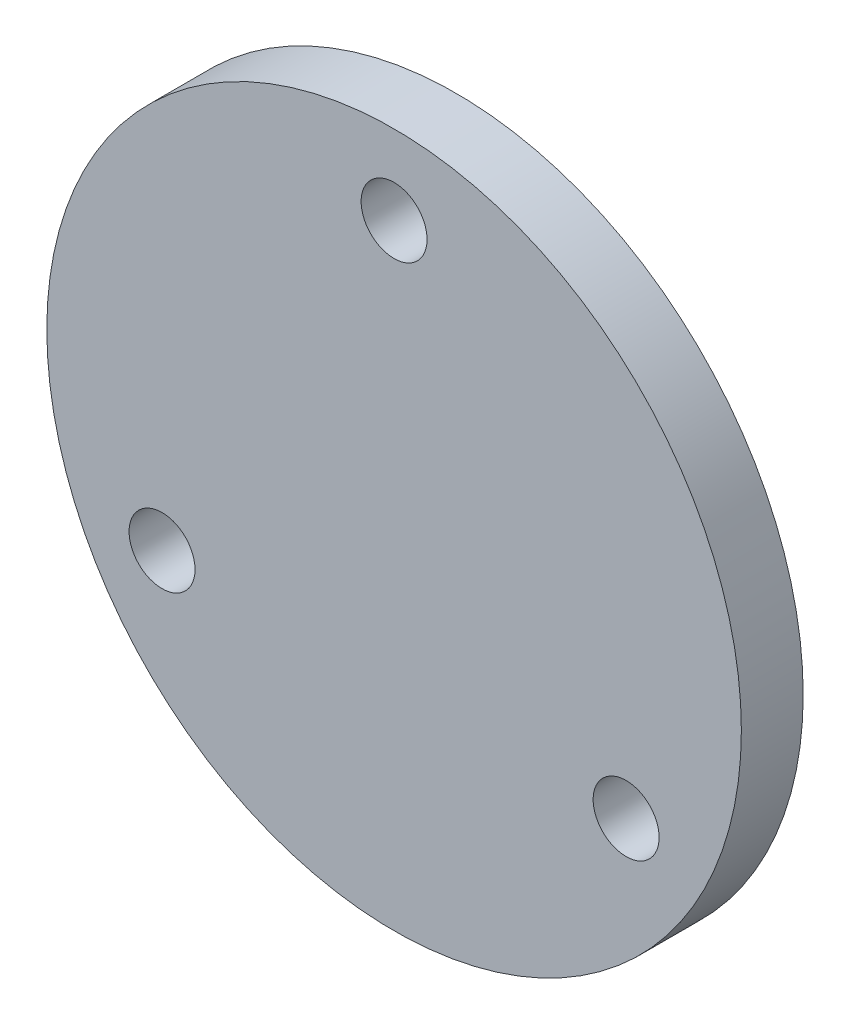
ISO-10303-21;
HEADER;
FILE_DESCRIPTION(('STEP AP214'),'2;1');
FILE_NAME('part.step','',(''),(''),'','','');
FILE_SCHEMA(('AUTOMOTIVE_DESIGN { 1 0 10303 214 1 1 1 1 }'));
ENDSEC;
DATA;
#1=APPLICATION_CONTEXT('core data for automotive mechanical design processes');
#2=APPLICATION_PROTOCOL_DEFINITION('international standard','automotive_design',2000,#1);
#3=PRODUCT_CONTEXT('',#1,'mechanical');
#4=PRODUCT('Part','Part','',(#3));
#5=PRODUCT_RELATED_PRODUCT_CATEGORY('part','',(#4));
#6=PRODUCT_DEFINITION_FORMATION('','',#4);
#7=PRODUCT_DEFINITION_CONTEXT('part definition',#1,'design');
#8=PRODUCT_DEFINITION('design','',#6,#7);
#9=PRODUCT_DEFINITION_SHAPE('','',#8);
#10=(LENGTH_UNIT() NAMED_UNIT(*) SI_UNIT(.MILLI.,.METRE.));
#11=(NAMED_UNIT(*) PLANE_ANGLE_UNIT() SI_UNIT($,.RADIAN.));
#12=(NAMED_UNIT(*) SI_UNIT($,.STERADIAN.) SOLID_ANGLE_UNIT());
#13=UNCERTAINTY_MEASURE_WITH_UNIT(LENGTH_MEASURE(1.E-05),#10,'distance_accuracy_value','');
#14=(GEOMETRIC_REPRESENTATION_CONTEXT(3) GLOBAL_UNCERTAINTY_ASSIGNED_CONTEXT((#13)) GLOBAL_UNIT_ASSIGNED_CONTEXT((#10,
#11,#12)) REPRESENTATION_CONTEXT('',''));
#15=CARTESIAN_POINT('',(0.,0.,0.));
#16=DIRECTION('',(0.,0.,1.));
#17=DIRECTION('',(1.,0.,0.));
#18=AXIS2_PLACEMENT_3D('',#15,#16,#17);
#19=CARTESIAN_POINT('',(0.,0.,3.));
#20=DIRECTION('',(0.,0.,1.));
#21=DIRECTION('',(1.,0.,0.));
#22=AXIS2_PLACEMENT_3D('',#19,#20,#21);
#23=PLANE('',#22);
#24=CARTESIAN_POINT('',(11.2583302491982,-6.49999999999974,3.));
#25=DIRECTION('',(0.,0.,1.));
#26=DIRECTION('',(1.,0.,0.));
#27=AXIS2_PLACEMENT_3D('',#24,#25,#26);
#28=CIRCLE('',#27,1.6);
#29=CARTESIAN_POINT('',(12.8583302491982,-6.49999999999974,3.));
#30=VERTEX_POINT('',#29);
#31=EDGE_CURVE('E58',#30,#30,#28,.T.);
#32=ORIENTED_EDGE('',*,*,#31,.F.);
#33=EDGE_LOOP('',(#32));
#34=FACE_BOUND('',#33,.T.);
#35=CARTESIAN_POINT('',(0.,0.,3.));
#36=DIRECTION('',(0.,0.,1.));
#37=DIRECTION('',(1.,0.,0.));
#38=AXIS2_PLACEMENT_3D('',#35,#36,#37);
#39=CIRCLE('',#38,16.85);
#40=CARTESIAN_POINT('',(16.85,0.,3.));
#41=VERTEX_POINT('',#40);
#42=EDGE_CURVE('E10',#41,#41,#39,.T.);
#43=ORIENTED_EDGE('',*,*,#42,.T.);
#44=EDGE_LOOP('',(#43));
#45=FACE_BOUND('',#44,.T.);
#46=CARTESIAN_POINT('',(0.,13.,3.));
#47=DIRECTION('',(0.,0.,1.));
#48=DIRECTION('',(1.,0.,0.));
#49=AXIS2_PLACEMENT_3D('',#46,#47,#48);
#50=CIRCLE('',#49,1.6);
#51=CARTESIAN_POINT('',(1.6,13.,3.));
#52=VERTEX_POINT('',#51);
#53=EDGE_CURVE('E52',#52,#52,#50,.T.);
#54=ORIENTED_EDGE('',*,*,#53,.F.);
#55=EDGE_LOOP('',(#54));
#56=FACE_BOUND('',#55,.T.);
#57=CARTESIAN_POINT('',(-11.2583302491973,-6.50000000000026,3.));
#58=DIRECTION('',(0.,0.,1.));
#59=DIRECTION('',(1.,0.,0.));
#60=AXIS2_PLACEMENT_3D('',#57,#58,#59);
#61=CIRCLE('',#60,1.6);
#62=CARTESIAN_POINT('',(-9.65833024919725,-6.50000000000026,3.));
#63=VERTEX_POINT('',#62);
#64=EDGE_CURVE('E66',#63,#63,#61,.T.);
#65=ORIENTED_EDGE('',*,*,#64,.F.);
#66=EDGE_LOOP('',(#65));
#67=FACE_BOUND('',#66,.T.);
#68=ADVANCED_FACE('F39',(#34,#45,#56,#67),#23,.T.);
#69=CARTESIAN_POINT('',(0.,0.,0.));
#70=DIRECTION('',(0.,0.,1.));
#71=DIRECTION('',(1.,0.,0.));
#72=AXIS2_PLACEMENT_3D('',#69,#70,#71);
#73=PLANE('',#72);
#74=CARTESIAN_POINT('',(0.,0.,0.));
#75=DIRECTION('',(0.,0.,1.));
#76=DIRECTION('',(1.,0.,0.));
#77=AXIS2_PLACEMENT_3D('',#74,#75,#76);
#78=CIRCLE('',#77,16.85);
#79=CARTESIAN_POINT('',(16.85,0.,0.));
#80=VERTEX_POINT('',#79);
#81=EDGE_CURVE('E43',#80,#80,#78,.T.);
#82=ORIENTED_EDGE('',*,*,#81,.F.);
#83=EDGE_LOOP('',(#82));
#84=FACE_BOUND('',#83,.T.);
#85=CARTESIAN_POINT('',(0.,13.,0.));
#86=DIRECTION('',(0.,0.,1.));
#87=DIRECTION('',(1.,0.,0.));
#88=AXIS2_PLACEMENT_3D('',#85,#86,#87);
#89=CIRCLE('',#88,1.6);
#90=CARTESIAN_POINT('',(1.6,13.,0.));
#91=VERTEX_POINT('',#90);
#92=EDGE_CURVE('E54',#91,#91,#89,.T.);
#93=ORIENTED_EDGE('',*,*,#92,.T.);
#94=EDGE_LOOP('',(#93));
#95=FACE_BOUND('',#94,.T.);
#96=CARTESIAN_POINT('',(11.2583302491982,-6.49999999999974,0.));
#97=DIRECTION('',(0.,0.,1.));
#98=DIRECTION('',(1.,0.,0.));
#99=AXIS2_PLACEMENT_3D('',#96,#97,#98);
#100=CIRCLE('',#99,1.6);
#101=CARTESIAN_POINT('',(12.8583302491982,-6.49999999999974,0.));
#102=VERTEX_POINT('',#101);
#103=EDGE_CURVE('E62',#102,#102,#100,.T.);
#104=ORIENTED_EDGE('',*,*,#103,.T.);
#105=EDGE_LOOP('',(#104));
#106=FACE_BOUND('',#105,.T.);
#107=CARTESIAN_POINT('',(-11.2583302491973,-6.50000000000026,0.));
#108=DIRECTION('',(0.,0.,1.));
#109=DIRECTION('',(1.,0.,0.));
#110=AXIS2_PLACEMENT_3D('',#107,#108,#109);
#111=CIRCLE('',#110,1.6);
#112=CARTESIAN_POINT('',(-9.65833024919725,-6.50000000000026,0.));
#113=VERTEX_POINT('',#112);
#114=EDGE_CURVE('E70',#113,#113,#111,.T.);
#115=ORIENTED_EDGE('',*,*,#114,.T.);
#116=EDGE_LOOP('',(#115));
#117=FACE_BOUND('',#116,.T.);
#118=ADVANCED_FACE('F82',(#84,#95,#106,#117),#73,.F.);
#119=CARTESIAN_POINT('',(0.,0.,3.));
#120=DIRECTION('',(0.,0.,-1.));
#121=DIRECTION('',(-1.,0.,0.));
#122=AXIS2_PLACEMENT_3D('',#119,#120,#121);
#123=CYLINDRICAL_SURFACE('',#122,16.85);
#124=ORIENTED_EDGE('',*,*,#42,.F.);
#125=EDGE_LOOP('',(#124));
#126=FACE_BOUND('',#125,.T.);
#127=ORIENTED_EDGE('',*,*,#81,.T.);
#128=EDGE_LOOP('',(#127));
#129=FACE_BOUND('',#128,.T.);
#130=ADVANCED_FACE('F41',(#126,#129),#123,.T.);
#131=CARTESIAN_POINT('',(0.,13.,3.));
#132=DIRECTION('',(0.,0.,-1.));
#133=DIRECTION('',(-1.,0.,0.));
#134=AXIS2_PLACEMENT_3D('',#131,#132,#133);
#135=CYLINDRICAL_SURFACE('',#134,1.6);
#136=ORIENTED_EDGE('',*,*,#53,.T.);
#137=EDGE_LOOP('',(#136));
#138=FACE_BOUND('',#137,.T.);
#139=ORIENTED_EDGE('',*,*,#92,.F.);
#140=EDGE_LOOP('',(#139));
#141=FACE_BOUND('',#140,.T.);
#142=ADVANCED_FACE('F91',(#138,#141),#135,.F.);
#143=CARTESIAN_POINT('',(11.2583302491982,-6.49999999999974,3.));
#144=DIRECTION('',(0.,0.,-1.));
#145=DIRECTION('',(-1.,0.,0.));
#146=AXIS2_PLACEMENT_3D('',#143,#144,#145);
#147=CYLINDRICAL_SURFACE('',#146,1.6);
#148=ORIENTED_EDGE('',*,*,#31,.T.);
#149=EDGE_LOOP('',(#148));
#150=FACE_BOUND('',#149,.T.);
#151=ORIENTED_EDGE('',*,*,#103,.F.);
#152=EDGE_LOOP('',(#151));
#153=FACE_BOUND('',#152,.T.);
#154=ADVANCED_FACE('F94',(#150,#153),#147,.F.);
#155=CARTESIAN_POINT('',(-11.2583302491973,-6.50000000000026,3.));
#156=DIRECTION('',(0.,0.,-1.));
#157=DIRECTION('',(-1.,0.,0.));
#158=AXIS2_PLACEMENT_3D('',#155,#156,#157);
#159=CYLINDRICAL_SURFACE('',#158,1.6);
#160=ORIENTED_EDGE('',*,*,#64,.T.);
#161=EDGE_LOOP('',(#160));
#162=FACE_BOUND('',#161,.T.);
#163=ORIENTED_EDGE('',*,*,#114,.F.);
#164=EDGE_LOOP('',(#163));
#165=FACE_BOUND('',#164,.T.);
#166=ADVANCED_FACE('F78',(#162,#165),#159,.F.);
#167=CLOSED_SHELL('',(#68,#118,#130,#142,#154,#166));
#168=MANIFOLD_SOLID_BREP('B2',#167);
#169=ADVANCED_BREP_SHAPE_REPRESENTATION('',(#18,#168),#14);
#170=SHAPE_DEFINITION_REPRESENTATION(#9,#169);
ENDSEC;
END-ISO-10303-21;
